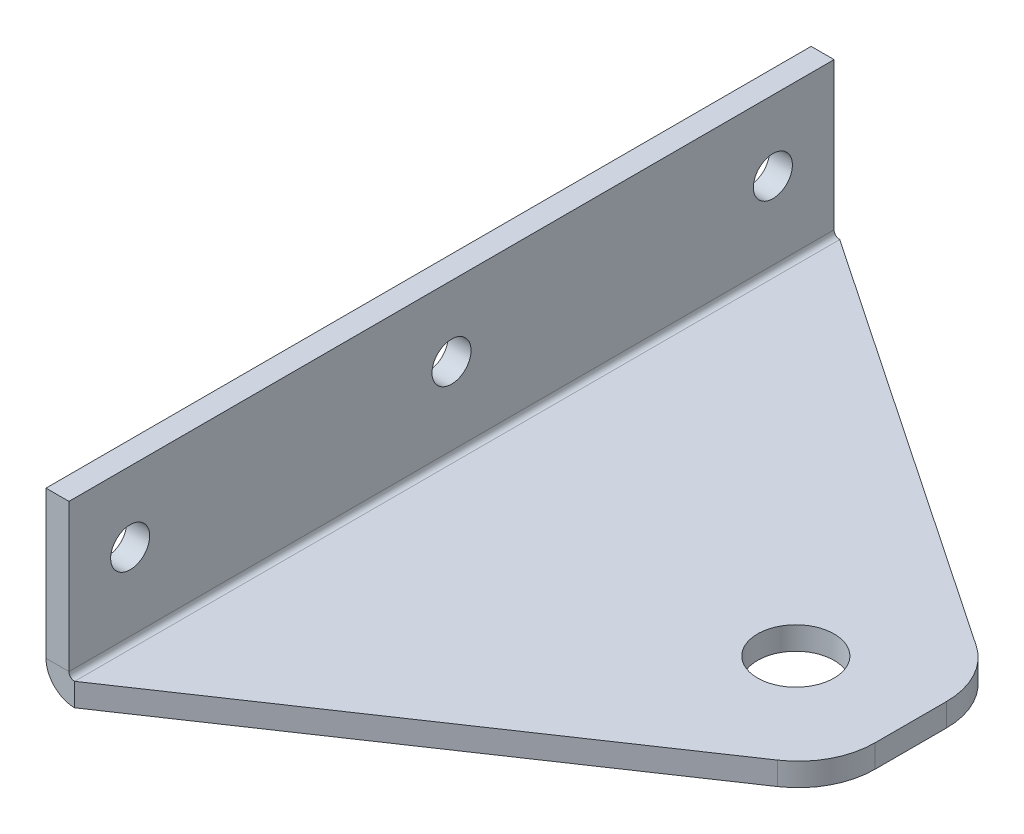
ISO-10303-21;
HEADER;
FILE_DESCRIPTION(('STEP AP214'),'2;1');
FILE_NAME('part.step','',(''),(''),'','','');
FILE_SCHEMA(('AUTOMOTIVE_DESIGN { 1 0 10303 214 1 1 1 1 }'));
ENDSEC;
DATA;
#1=APPLICATION_CONTEXT('core data for automotive mechanical design processes');
#2=APPLICATION_PROTOCOL_DEFINITION('international standard','automotive_design',2000,#1);
#3=PRODUCT_CONTEXT('',#1,'mechanical');
#4=PRODUCT('Part','Part','',(#3));
#5=PRODUCT_RELATED_PRODUCT_CATEGORY('part','',(#4));
#6=PRODUCT_DEFINITION_FORMATION('','',#4);
#7=PRODUCT_DEFINITION_CONTEXT('part definition',#1,'design');
#8=PRODUCT_DEFINITION('design','',#6,#7);
#9=PRODUCT_DEFINITION_SHAPE('','',#8);
#10=(LENGTH_UNIT() NAMED_UNIT(*) SI_UNIT(.MILLI.,.METRE.));
#11=(NAMED_UNIT(*) PLANE_ANGLE_UNIT() SI_UNIT($,.RADIAN.));
#12=(NAMED_UNIT(*) SI_UNIT($,.STERADIAN.) SOLID_ANGLE_UNIT());
#13=UNCERTAINTY_MEASURE_WITH_UNIT(LENGTH_MEASURE(1.E-05),#10,'distance_accuracy_value','');
#14=(GEOMETRIC_REPRESENTATION_CONTEXT(3) GLOBAL_UNCERTAINTY_ASSIGNED_CONTEXT((#13)) GLOBAL_UNIT_ASSIGNED_CONTEXT((#10,
#11,#12)) REPRESENTATION_CONTEXT('',''));
#15=CARTESIAN_POINT('',(0.,0.,0.));
#16=DIRECTION('',(0.,0.,1.));
#17=DIRECTION('',(1.,0.,0.));
#18=AXIS2_PLACEMENT_3D('',#15,#16,#17);
#19=CARTESIAN_POINT('',(0.,-3.,100.));
#20=DIRECTION('',(0.,1.,0.));
#21=DIRECTION('',(0.,0.,1.));
#22=AXIS2_PLACEMENT_3D('',#19,#20,#21);
#23=PLANE('',#22);
#24=CARTESIAN_POINT('',(45.,-3.,50.));
#25=DIRECTION('',(0.,1.,0.));
#26=DIRECTION('',(0.,0.,1.));
#27=AXIS2_PLACEMENT_3D('',#24,#25,#26);
#28=CIRCLE('',#27,5.);
#29=CARTESIAN_POINT('',(45.,-3.,55.));
#30=VERTEX_POINT('',#29);
#31=EDGE_CURVE('E203',#30,#30,#28,.F.);
#32=ORIENTED_EDGE('',*,*,#31,.F.);
#33=EDGE_LOOP('',(#32));
#34=FACE_BOUND('',#33,.T.);
#35=DIRECTION('',(-0.828866800988088,0.,0.559445999377753));
#36=VECTOR('',#35,1.);
#37=CARTESIAN_POINT('',(0.230540939993486,-3.,100.34156599858));
#38=LINE('',#37,#36);
#39=CARTESIAN_POINT('',(55.5944599937775,-3.,62.9735317286707));
#40=VERTEX_POINT('',#39);
#41=CARTESIAN_POINT('',(0.7366,-3.,100.));
#42=VERTEX_POINT('',#41);
#43=EDGE_CURVE('E223',#40,#42,#38,.T.);
#44=ORIENTED_EDGE('',*,*,#43,.T.);
#45=DIRECTION('',(0.,0.,-1.));
#46=VECTOR('',#45,1.);
#47=CARTESIAN_POINT('',(0.7366,-3.,100.));
#48=LINE('',#47,#46);
#49=CARTESIAN_POINT('',(0.7366,-3.,0.));
#50=VERTEX_POINT('',#49);
#51=EDGE_CURVE('E131',#42,#50,#48,.T.);
#52=ORIENTED_EDGE('',*,*,#51,.T.);
#53=DIRECTION('',(0.828866800988088,0.,0.559445999377753));
#54=VECTOR('',#53,1.);
#55=CARTESIAN_POINT('',(46.6011625229757,-3.,30.956416623397));
#56=LINE('',#55,#54);
#57=CARTESIAN_POINT('',(55.5944599937775,-3.,37.0264682713293));
#58=VERTEX_POINT('',#57);
#59=EDGE_CURVE('E84',#50,#58,#56,.T.);
#60=ORIENTED_EDGE('',*,*,#59,.T.);
#61=CARTESIAN_POINT('',(50.,-3.,45.3151362812103));
#62=DIRECTION('',(0.,1.,0.));
#63=DIRECTION('',(0.,0.,1.));
#64=AXIS2_PLACEMENT_3D('',#61,#62,#63);
#65=CIRCLE('',#64,9.99999999999999);
#66=CARTESIAN_POINT('',(60.,-3.,45.3151362812103));
#67=VERTEX_POINT('',#66);
#68=EDGE_CURVE('E179',#58,#67,#65,.F.);
#69=ORIENTED_EDGE('',*,*,#68,.T.);
#70=DIRECTION('',(0.,0.,-1.));
#71=VECTOR('',#70,1.);
#72=CARTESIAN_POINT('',(60.,-3.,100.));
#73=LINE('',#72,#71);
#74=CARTESIAN_POINT('',(60.,-3.,54.6848637187897));
#75=VERTEX_POINT('',#74);
#76=EDGE_CURVE('E157',#75,#67,#73,.T.);
#77=ORIENTED_EDGE('',*,*,#76,.F.);
#78=CARTESIAN_POINT('',(50.,-3.,54.6848637187897));
#79=DIRECTION('',(0.,1.,0.));
#80=DIRECTION('',(0.,0.,1.));
#81=AXIS2_PLACEMENT_3D('',#78,#79,#80);
#82=CIRCLE('',#81,10.);
#83=EDGE_CURVE('E227',#75,#40,#82,.F.);
#84=ORIENTED_EDGE('',*,*,#83,.T.);
#85=EDGE_LOOP('',(#44,#52,#60,#69,#77,#84));
#86=FACE_BOUND('',#85,.T.);
#87=ADVANCED_FACE('F39',(#34,#86),#23,.F.);
#88=CARTESIAN_POINT('',(0.,0.,100.));
#89=DIRECTION('',(0.,1.,0.));
#90=DIRECTION('',(0.,0.,1.));
#91=AXIS2_PLACEMENT_3D('',#88,#89,#90);
#92=PLANE('',#91);
#93=CARTESIAN_POINT('',(45.,0.,50.));
#94=DIRECTION('',(0.,1.,0.));
#95=DIRECTION('',(0.,0.,1.));
#96=AXIS2_PLACEMENT_3D('',#93,#94,#95);
#97=CIRCLE('',#96,5.);
#98=CARTESIAN_POINT('',(45.,0.,55.));
#99=VERTEX_POINT('',#98);
#100=EDGE_CURVE('E206',#99,#99,#97,.T.);
#101=ORIENTED_EDGE('',*,*,#100,.F.);
#102=EDGE_LOOP('',(#101));
#103=FACE_BOUND('',#102,.T.);
#104=DIRECTION('',(0.,0.,-1.));
#105=VECTOR('',#104,1.);
#106=CARTESIAN_POINT('',(0.7366,0.,100.));
#107=LINE('',#106,#105);
#108=CARTESIAN_POINT('',(0.7366,0.,100.));
#109=VERTEX_POINT('',#108);
#110=CARTESIAN_POINT('',(0.7366,0.,0.));
#111=VERTEX_POINT('',#110);
#112=EDGE_CURVE('E151',#109,#111,#107,.T.);
#113=ORIENTED_EDGE('',*,*,#112,.F.);
#114=DIRECTION('',(-0.828866800988088,0.,0.559445999377753));
#115=VECTOR('',#114,1.);
#116=CARTESIAN_POINT('',(0.230540939993486,0.,100.34156599858));
#117=LINE('',#116,#115);
#118=CARTESIAN_POINT('',(55.5944599937775,0.,62.9735317286707));
#119=VERTEX_POINT('',#118);
#120=EDGE_CURVE('E92',#119,#109,#117,.T.);
#121=ORIENTED_EDGE('',*,*,#120,.F.);
#122=CARTESIAN_POINT('',(50.,0.,54.6848637187897));
#123=DIRECTION('',(0.,1.,0.));
#124=DIRECTION('',(0.,0.,1.));
#125=AXIS2_PLACEMENT_3D('',#122,#123,#124);
#126=CIRCLE('',#125,10.);
#127=CARTESIAN_POINT('',(60.,0.,54.6848637187897));
#128=VERTEX_POINT('',#127);
#129=EDGE_CURVE('E226',#128,#119,#126,.F.);
#130=ORIENTED_EDGE('',*,*,#129,.F.);
#131=DIRECTION('',(0.,0.,-1.));
#132=VECTOR('',#131,1.);
#133=CARTESIAN_POINT('',(60.,0.,100.));
#134=LINE('',#133,#132);
#135=CARTESIAN_POINT('',(60.,0.,45.3151362812103));
#136=VERTEX_POINT('',#135);
#137=EDGE_CURVE('E154',#128,#136,#134,.T.);
#138=ORIENTED_EDGE('',*,*,#137,.T.);
#139=CARTESIAN_POINT('',(50.,0.,45.3151362812103));
#140=DIRECTION('',(0.,1.,0.));
#141=DIRECTION('',(0.,0.,1.));
#142=AXIS2_PLACEMENT_3D('',#139,#140,#141);
#143=CIRCLE('',#142,9.99999999999999);
#144=CARTESIAN_POINT('',(55.5944599937775,0.,37.0264682713294));
#145=VERTEX_POINT('',#144);
#146=EDGE_CURVE('E178',#145,#136,#143,.F.);
#147=ORIENTED_EDGE('',*,*,#146,.F.);
#148=DIRECTION('',(0.828866800988088,0.,0.559445999377753));
#149=VECTOR('',#148,1.);
#150=CARTESIAN_POINT('',(46.6011625229757,0.,30.956416623397));
#151=LINE('',#150,#149);
#152=EDGE_CURVE('E166',#111,#145,#151,.T.);
#153=ORIENTED_EDGE('',*,*,#152,.F.);
#154=EDGE_LOOP('',(#113,#121,#130,#138,#147,#153));
#155=FACE_BOUND('',#154,.T.);
#156=ADVANCED_FACE('F175',(#103,#155),#92,.T.);
#157=CARTESIAN_POINT('',(60.,0.,100.));
#158=DIRECTION('',(1.,0.,0.));
#159=DIRECTION('',(0.,0.,-1.));
#160=AXIS2_PLACEMENT_3D('',#157,#158,#159);
#161=PLANE('',#160);
#162=DIRECTION('',(0.,-1.,0.));
#163=VECTOR('',#162,1.);
#164=CARTESIAN_POINT('',(60.,-3.,54.6848637187897));
#165=LINE('',#164,#163);
#166=EDGE_CURVE('E219',#75,#128,#165,.F.);
#167=ORIENTED_EDGE('',*,*,#166,.F.);
#168=ORIENTED_EDGE('',*,*,#76,.T.);
#169=DIRECTION('',(0.,-1.,0.));
#170=VECTOR('',#169,1.);
#171=CARTESIAN_POINT('',(60.,-3.,45.3151362812103));
#172=LINE('',#171,#170);
#173=EDGE_CURVE('E209',#67,#136,#172,.F.);
#174=ORIENTED_EDGE('',*,*,#173,.T.);
#175=ORIENTED_EDGE('',*,*,#137,.F.);
#176=EDGE_LOOP('',(#167,#168,#174,#175));
#177=FACE_BOUND('',#176,.T.);
#178=ADVANCED_FACE('F273',(#177),#161,.T.);
#179=CARTESIAN_POINT('',(0.7366,0.,100.));
#180=DIRECTION('',(0.,0.,1.));
#181=DIRECTION('',(1.,0.,0.));
#182=AXIS2_PLACEMENT_3D('',#179,#180,#181);
#183=PLANE('',#182);
#184=DIRECTION('',(0.,-1.,0.));
#185=VECTOR('',#184,1.);
#186=CARTESIAN_POINT('',(0.7366,0.,100.));
#187=LINE('',#186,#185);
#188=EDGE_CURVE('E11',#109,#42,#187,.T.);
#189=ORIENTED_EDGE('',*,*,#188,.F.);
#190=CARTESIAN_POINT('',(0.7366,0.7366,100.));
#191=DIRECTION('',(0.,0.,-1.));
#192=DIRECTION('',(-1.,0.,0.));
#193=AXIS2_PLACEMENT_3D('',#190,#191,#192);
#194=CIRCLE('',#193,0.7366);
#195=CARTESIAN_POINT('',(0.,0.7366,100.));
#196=VERTEX_POINT('',#195);
#197=EDGE_CURVE('E120',#196,#109,#194,.F.);
#198=ORIENTED_EDGE('',*,*,#197,.F.);
#199=DIRECTION('',(1.,0.,0.));
#200=VECTOR('',#199,1.);
#201=CARTESIAN_POINT('',(-3.,0.736600000000001,100.));
#202=LINE('',#201,#200);
#203=CARTESIAN_POINT('',(-3.,0.736600000000001,100.));
#204=VERTEX_POINT('',#203);
#205=EDGE_CURVE('E48',#204,#196,#202,.T.);
#206=ORIENTED_EDGE('',*,*,#205,.F.);
#207=CARTESIAN_POINT('',(0.7366,0.7366,100.));
#208=DIRECTION('',(0.,0.,1.));
#209=DIRECTION('',(1.,0.,0.));
#210=AXIS2_PLACEMENT_3D('',#207,#208,#209);
#211=CIRCLE('',#210,3.7366);
#212=EDGE_CURVE('E126',#204,#42,#211,.T.);
#213=ORIENTED_EDGE('',*,*,#212,.T.);
#214=EDGE_LOOP('',(#189,#198,#206,#213));
#215=FACE_BOUND('',#214,.T.);
#216=ADVANCED_FACE('F41',(#215),#183,.T.);
#217=CARTESIAN_POINT('',(0.,0.7366,0.));
#218=DIRECTION('',(0.,0.,-1.));
#219=DIRECTION('',(-1.,0.,0.));
#220=AXIS2_PLACEMENT_3D('',#217,#218,#219);
#221=PLANE('',#220);
#222=DIRECTION('',(-1.,0.,0.));
#223=VECTOR('',#222,1.);
#224=CARTESIAN_POINT('',(0.,0.7366,0.));
#225=LINE('',#224,#223);
#226=CARTESIAN_POINT('',(0.,0.7366,0.));
#227=VERTEX_POINT('',#226);
#228=CARTESIAN_POINT('',(-3.,0.736600000000001,0.));
#229=VERTEX_POINT('',#228);
#230=EDGE_CURVE('E76',#227,#229,#225,.T.);
#231=ORIENTED_EDGE('',*,*,#230,.F.);
#232=CARTESIAN_POINT('',(0.7366,0.7366,0.));
#233=DIRECTION('',(0.,0.,-1.));
#234=DIRECTION('',(-1.,0.,0.));
#235=AXIS2_PLACEMENT_3D('',#232,#233,#234);
#236=CIRCLE('',#235,0.7366);
#237=EDGE_CURVE('E132',#227,#111,#236,.F.);
#238=ORIENTED_EDGE('',*,*,#237,.T.);
#239=DIRECTION('',(0.,1.,0.));
#240=VECTOR('',#239,1.);
#241=CARTESIAN_POINT('',(0.7366,-3.,0.));
#242=LINE('',#241,#240);
#243=EDGE_CURVE('E160',#50,#111,#242,.T.);
#244=ORIENTED_EDGE('',*,*,#243,.F.);
#245=CARTESIAN_POINT('',(0.7366,0.7366,0.));
#246=DIRECTION('',(0.,0.,1.));
#247=DIRECTION('',(1.,0.,0.));
#248=AXIS2_PLACEMENT_3D('',#245,#246,#247);
#249=CIRCLE('',#248,3.7366);
#250=EDGE_CURVE('E141',#229,#50,#249,.T.);
#251=ORIENTED_EDGE('',*,*,#250,.F.);
#252=EDGE_LOOP('',(#231,#238,#244,#251));
#253=FACE_BOUND('',#252,.T.);
#254=ADVANCED_FACE('F184',(#253),#221,.T.);
#255=CARTESIAN_POINT('',(0.7366,-3.,0.));
#256=DIRECTION('',(0.,0.,-1.));
#257=DIRECTION('',(-1.,0.,0.));
#258=AXIS2_PLACEMENT_3D('',#255,#256,#257);
#259=PLANE('',#258);
#260=DIRECTION('',(0.,-1.,0.));
#261=VECTOR('',#260,1.);
#262=CARTESIAN_POINT('',(0.,20.,0.));
#263=LINE('',#262,#261);
#264=CARTESIAN_POINT('',(0.,20.,0.));
#265=VERTEX_POINT('',#264);
#266=EDGE_CURVE('E107',#265,#227,#263,.T.);
#267=ORIENTED_EDGE('',*,*,#266,.T.);
#268=ORIENTED_EDGE('',*,*,#230,.T.);
#269=DIRECTION('',(0.,-1.,0.));
#270=VECTOR('',#269,1.);
#271=CARTESIAN_POINT('',(-3.,20.,0.));
#272=LINE('',#271,#270);
#273=CARTESIAN_POINT('',(-3.,20.,0.));
#274=VERTEX_POINT('',#273);
#275=EDGE_CURVE('E139',#274,#229,#272,.T.);
#276=ORIENTED_EDGE('',*,*,#275,.F.);
#277=DIRECTION('',(1.,0.,0.));
#278=VECTOR('',#277,1.);
#279=CARTESIAN_POINT('',(-3.,20.,0.));
#280=LINE('',#279,#278);
#281=EDGE_CURVE('E137',#274,#265,#280,.T.);
#282=ORIENTED_EDGE('',*,*,#281,.T.);
#283=EDGE_LOOP('',(#267,#268,#276,#282));
#284=FACE_BOUND('',#283,.T.);
#285=ADVANCED_FACE('F259',(#284),#259,.T.);
#286=CARTESIAN_POINT('',(0.7366,0.7366,100.));
#287=DIRECTION('',(0.,0.,-1.));
#288=DIRECTION('',(-1.,0.,0.));
#289=AXIS2_PLACEMENT_3D('',#286,#287,#288);
#290=CYLINDRICAL_SURFACE('',#289,0.7366);
#291=ORIENTED_EDGE('',*,*,#237,.F.);
#292=DIRECTION('',(0.,0.,-1.));
#293=VECTOR('',#292,1.);
#294=CARTESIAN_POINT('',(0.,0.7366,100.));
#295=LINE('',#294,#293);
#296=EDGE_CURVE('E112',#196,#227,#295,.T.);
#297=ORIENTED_EDGE('',*,*,#296,.F.);
#298=ORIENTED_EDGE('',*,*,#197,.T.);
#299=ORIENTED_EDGE('',*,*,#112,.T.);
#300=EDGE_LOOP('',(#291,#297,#298,#299));
#301=FACE_BOUND('',#300,.T.);
#302=ADVANCED_FACE('F183',(#301),#290,.F.);
#303=CARTESIAN_POINT('',(0.,20.,100.));
#304=DIRECTION('',(1.,0.,0.));
#305=DIRECTION('',(0.,1.,0.));
#306=AXIS2_PLACEMENT_3D('',#303,#304,#305);
#307=PLANE('',#306);
#308=CARTESIAN_POINT('',(0.,10.8130821861345,50.));
#309=DIRECTION('',(1.,0.,0.));
#310=DIRECTION('',(0.,1.,0.));
#311=AXIS2_PLACEMENT_3D('',#308,#309,#310);
#312=CIRCLE('',#311,2.55);
#313=CARTESIAN_POINT('',(0.,13.3630821861345,50.));
#314=VERTEX_POINT('',#313);
#315=EDGE_CURVE('E200',#314,#314,#312,.T.);
#316=ORIENTED_EDGE('',*,*,#315,.F.);
#317=EDGE_LOOP('',(#316));
#318=FACE_BOUND('',#317,.T.);
#319=CARTESIAN_POINT('',(0.,10.8130821861345,8.));
#320=DIRECTION('',(1.,0.,0.));
#321=DIRECTION('',(0.,1.,0.));
#322=AXIS2_PLACEMENT_3D('',#319,#320,#321);
#323=CIRCLE('',#322,2.55);
#324=CARTESIAN_POINT('',(0.,13.3630821861345,8.));
#325=VERTEX_POINT('',#324);
#326=EDGE_CURVE('E194',#325,#325,#323,.T.);
#327=ORIENTED_EDGE('',*,*,#326,.F.);
#328=EDGE_LOOP('',(#327));
#329=FACE_BOUND('',#328,.T.);
#330=CARTESIAN_POINT('',(0.,10.8130821861345,92.));
#331=DIRECTION('',(1.,0.,0.));
#332=DIRECTION('',(0.,1.,0.));
#333=AXIS2_PLACEMENT_3D('',#330,#331,#332);
#334=CIRCLE('',#333,2.54999999999999);
#335=CARTESIAN_POINT('',(0.,13.3630821861345,92.));
#336=VERTEX_POINT('',#335);
#337=EDGE_CURVE('E188',#336,#336,#334,.T.);
#338=ORIENTED_EDGE('',*,*,#337,.F.);
#339=EDGE_LOOP('',(#338));
#340=FACE_BOUND('',#339,.T.);
#341=ORIENTED_EDGE('',*,*,#266,.F.);
#342=DIRECTION('',(0.,0.,-1.));
#343=VECTOR('',#342,1.);
#344=CARTESIAN_POINT('',(0.,20.,100.));
#345=LINE('',#344,#343);
#346=CARTESIAN_POINT('',(0.,20.,100.));
#347=VERTEX_POINT('',#346);
#348=EDGE_CURVE('E102',#347,#265,#345,.T.);
#349=ORIENTED_EDGE('',*,*,#348,.F.);
#350=DIRECTION('',(0.,-1.,0.));
#351=VECTOR('',#350,1.);
#352=CARTESIAN_POINT('',(0.,20.,100.));
#353=LINE('',#352,#351);
#354=EDGE_CURVE('E106',#347,#196,#353,.T.);
#355=ORIENTED_EDGE('',*,*,#354,.T.);
#356=ORIENTED_EDGE('',*,*,#296,.T.);
#357=EDGE_LOOP('',(#341,#349,#355,#356));
#358=FACE_BOUND('',#357,.T.);
#359=ADVANCED_FACE('F104',(#318,#329,#340,#358),#307,.T.);
#360=CARTESIAN_POINT('',(-3.,20.,100.));
#361=DIRECTION('',(0.,1.,0.));
#362=DIRECTION('',(0.,0.,1.));
#363=AXIS2_PLACEMENT_3D('',#360,#361,#362);
#364=PLANE('',#363);
#365=ORIENTED_EDGE('',*,*,#281,.F.);
#366=DIRECTION('',(0.,0.,-1.));
#367=VECTOR('',#366,1.);
#368=CARTESIAN_POINT('',(-3.,20.,100.));
#369=LINE('',#368,#367);
#370=CARTESIAN_POINT('',(-3.,20.,100.));
#371=VERTEX_POINT('',#370);
#372=EDGE_CURVE('E113',#371,#274,#369,.T.);
#373=ORIENTED_EDGE('',*,*,#372,.F.);
#374=DIRECTION('',(1.,0.,0.));
#375=VECTOR('',#374,1.);
#376=CARTESIAN_POINT('',(-3.,20.,100.));
#377=LINE('',#376,#375);
#378=EDGE_CURVE('E118',#371,#347,#377,.T.);
#379=ORIENTED_EDGE('',*,*,#378,.T.);
#380=ORIENTED_EDGE('',*,*,#348,.T.);
#381=EDGE_LOOP('',(#365,#373,#379,#380));
#382=FACE_BOUND('',#381,.T.);
#383=ADVANCED_FACE('F122',(#382),#364,.T.);
#384=CARTESIAN_POINT('',(-3.,20.,100.));
#385=DIRECTION('',(1.,0.,0.));
#386=DIRECTION('',(0.,1.,0.));
#387=AXIS2_PLACEMENT_3D('',#384,#385,#386);
#388=PLANE('',#387);
#389=CARTESIAN_POINT('',(-3.,10.8130821861345,50.));
#390=DIRECTION('',(1.,0.,0.));
#391=DIRECTION('',(0.,1.,0.));
#392=AXIS2_PLACEMENT_3D('',#389,#390,#391);
#393=CIRCLE('',#392,2.55);
#394=CARTESIAN_POINT('',(-3.,13.3630821861345,50.));
#395=VERTEX_POINT('',#394);
#396=EDGE_CURVE('E197',#395,#395,#393,.F.);
#397=ORIENTED_EDGE('',*,*,#396,.F.);
#398=EDGE_LOOP('',(#397));
#399=FACE_BOUND('',#398,.T.);
#400=CARTESIAN_POINT('',(-3.,10.8130821861345,8.));
#401=DIRECTION('',(1.,0.,0.));
#402=DIRECTION('',(0.,1.,0.));
#403=AXIS2_PLACEMENT_3D('',#400,#401,#402);
#404=CIRCLE('',#403,2.55);
#405=CARTESIAN_POINT('',(-3.,13.3630821861345,8.));
#406=VERTEX_POINT('',#405);
#407=EDGE_CURVE('E191',#406,#406,#404,.F.);
#408=ORIENTED_EDGE('',*,*,#407,.F.);
#409=EDGE_LOOP('',(#408));
#410=FACE_BOUND('',#409,.T.);
#411=CARTESIAN_POINT('',(-3.,10.8130821861345,92.));
#412=DIRECTION('',(1.,0.,0.));
#413=DIRECTION('',(0.,1.,0.));
#414=AXIS2_PLACEMENT_3D('',#411,#412,#413);
#415=CIRCLE('',#414,2.54999999999999);
#416=CARTESIAN_POINT('',(-3.,13.3630821861345,92.));
#417=VERTEX_POINT('',#416);
#418=EDGE_CURVE('E135',#417,#417,#415,.F.);
#419=ORIENTED_EDGE('',*,*,#418,.F.);
#420=EDGE_LOOP('',(#419));
#421=FACE_BOUND('',#420,.T.);
#422=ORIENTED_EDGE('',*,*,#275,.T.);
#423=DIRECTION('',(0.,0.,-1.));
#424=VECTOR('',#423,1.);
#425=CARTESIAN_POINT('',(-3.,0.736600000000001,100.));
#426=LINE('',#425,#424);
#427=EDGE_CURVE('E146',#204,#229,#426,.T.);
#428=ORIENTED_EDGE('',*,*,#427,.F.);
#429=DIRECTION('',(0.,-1.,0.));
#430=VECTOR('',#429,1.);
#431=CARTESIAN_POINT('',(-3.,20.,100.));
#432=LINE('',#431,#430);
#433=EDGE_CURVE('E124',#371,#204,#432,.T.);
#434=ORIENTED_EDGE('',*,*,#433,.F.);
#435=ORIENTED_EDGE('',*,*,#372,.T.);
#436=EDGE_LOOP('',(#422,#428,#434,#435));
#437=FACE_BOUND('',#436,.T.);
#438=ADVANCED_FACE('F258',(#399,#410,#421,#437),#388,.F.);
#439=CARTESIAN_POINT('',(0.7366,0.7366,100.));
#440=DIRECTION('',(0.,0.,-1.));
#441=DIRECTION('',(-1.,0.,0.));
#442=AXIS2_PLACEMENT_3D('',#439,#440,#441);
#443=CYLINDRICAL_SURFACE('',#442,3.7366);
#444=ORIENTED_EDGE('',*,*,#250,.T.);
#445=ORIENTED_EDGE('',*,*,#51,.F.);
#446=ORIENTED_EDGE('',*,*,#212,.F.);
#447=ORIENTED_EDGE('',*,*,#427,.T.);
#448=EDGE_LOOP('',(#444,#445,#446,#447));
#449=FACE_BOUND('',#448,.T.);
#450=ADVANCED_FACE('F255',(#449),#443,.T.);
#451=CARTESIAN_POINT('',(0.7366,0.7366,100.));
#452=DIRECTION('',(0.,0.,-1.));
#453=DIRECTION('',(-1.,0.,0.));
#454=AXIS2_PLACEMENT_3D('',#451,#452,#453);
#455=PLANE('',#454);
#456=ORIENTED_EDGE('',*,*,#433,.T.);
#457=ORIENTED_EDGE('',*,*,#205,.T.);
#458=ORIENTED_EDGE('',*,*,#354,.F.);
#459=ORIENTED_EDGE('',*,*,#378,.F.);
#460=EDGE_LOOP('',(#456,#457,#458,#459));
#461=FACE_BOUND('',#460,.T.);
#462=ADVANCED_FACE('F117',(#461),#455,.F.);
#463=CARTESIAN_POINT('',(-3.001,10.8130821861345,92.));
#464=DIRECTION('',(1.,0.,0.));
#465=DIRECTION('',(0.,1.,0.));
#466=AXIS2_PLACEMENT_3D('',#463,#464,#465);
#467=CYLINDRICAL_SURFACE('',#466,2.54999999999999);
#468=ORIENTED_EDGE('',*,*,#337,.T.);
#469=EDGE_LOOP('',(#468));
#470=FACE_BOUND('',#469,.T.);
#471=ORIENTED_EDGE('',*,*,#418,.T.);
#472=EDGE_LOOP('',(#471));
#473=FACE_BOUND('',#472,.T.);
#474=ADVANCED_FACE('F293',(#470,#473),#467,.F.);
#475=CARTESIAN_POINT('',(-3.001,10.8130821861345,8.));
#476=DIRECTION('',(1.,0.,0.));
#477=DIRECTION('',(0.,1.,0.));
#478=AXIS2_PLACEMENT_3D('',#475,#476,#477);
#479=CYLINDRICAL_SURFACE('',#478,2.55);
#480=ORIENTED_EDGE('',*,*,#326,.T.);
#481=EDGE_LOOP('',(#480));
#482=FACE_BOUND('',#481,.T.);
#483=ORIENTED_EDGE('',*,*,#407,.T.);
#484=EDGE_LOOP('',(#483));
#485=FACE_BOUND('',#484,.T.);
#486=ADVANCED_FACE('F296',(#482,#485),#479,.F.);
#487=CARTESIAN_POINT('',(-3.001,10.8130821861345,50.));
#488=DIRECTION('',(1.,0.,0.));
#489=DIRECTION('',(0.,1.,0.));
#490=AXIS2_PLACEMENT_3D('',#487,#488,#489);
#491=CYLINDRICAL_SURFACE('',#490,2.55);
#492=ORIENTED_EDGE('',*,*,#315,.T.);
#493=EDGE_LOOP('',(#492));
#494=FACE_BOUND('',#493,.T.);
#495=ORIENTED_EDGE('',*,*,#396,.T.);
#496=EDGE_LOOP('',(#495));
#497=FACE_BOUND('',#496,.T.);
#498=ADVANCED_FACE('F300',(#494,#497),#491,.F.);
#499=CARTESIAN_POINT('',(45.,-3.001,50.));
#500=DIRECTION('',(0.,1.,0.));
#501=DIRECTION('',(0.,0.,1.));
#502=AXIS2_PLACEMENT_3D('',#499,#500,#501);
#503=CYLINDRICAL_SURFACE('',#502,5.);
#504=ORIENTED_EDGE('',*,*,#100,.T.);
#505=EDGE_LOOP('',(#504));
#506=FACE_BOUND('',#505,.T.);
#507=ORIENTED_EDGE('',*,*,#31,.T.);
#508=EDGE_LOOP('',(#507));
#509=FACE_BOUND('',#508,.T.);
#510=ADVANCED_FACE('F304',(#506,#509),#503,.F.);
#511=CARTESIAN_POINT('',(50.,-3.,45.3151362812103));
#512=DIRECTION('',(0.,1.,0.));
#513=DIRECTION('',(0.,0.,1.));
#514=AXIS2_PLACEMENT_3D('',#511,#512,#513);
#515=CYLINDRICAL_SURFACE('',#514,9.99999999999999);
#516=ORIENTED_EDGE('',*,*,#173,.F.);
#517=ORIENTED_EDGE('',*,*,#68,.F.);
#518=DIRECTION('',(0.,-1.,0.));
#519=VECTOR('',#518,1.);
#520=CARTESIAN_POINT('',(55.5944599937775,-3.,37.0264682713293));
#521=LINE('',#520,#519);
#522=EDGE_CURVE('E212',#58,#145,#521,.F.);
#523=ORIENTED_EDGE('',*,*,#522,.T.);
#524=ORIENTED_EDGE('',*,*,#146,.T.);
#525=EDGE_LOOP('',(#516,#517,#523,#524));
#526=FACE_BOUND('',#525,.T.);
#527=ADVANCED_FACE('F308',(#526),#515,.T.);
#528=CARTESIAN_POINT('',(46.6011625229757,-3.,30.956416623397));
#529=DIRECTION('',(-0.559445999377753,0.,0.828866800988088));
#530=DIRECTION('',(0.828866800988088,0.,0.559445999377753));
#531=AXIS2_PLACEMENT_3D('',#528,#529,#530);
#532=PLANE('',#531);
#533=ORIENTED_EDGE('',*,*,#522,.F.);
#534=ORIENTED_EDGE('',*,*,#59,.F.);
#535=ORIENTED_EDGE('',*,*,#243,.T.);
#536=ORIENTED_EDGE('',*,*,#152,.T.);
#537=EDGE_LOOP('',(#533,#534,#535,#536));
#538=FACE_BOUND('',#537,.T.);
#539=ADVANCED_FACE('F165',(#538),#532,.F.);
#540=CARTESIAN_POINT('',(0.230540939993486,-3.,100.34156599858));
#541=DIRECTION('',(-0.559445999377753,0.,-0.828866800988088));
#542=DIRECTION('',(-0.828866800988088,0.,0.559445999377753));
#543=AXIS2_PLACEMENT_3D('',#540,#541,#542);
#544=PLANE('',#543);
#545=ORIENTED_EDGE('',*,*,#188,.T.);
#546=ORIENTED_EDGE('',*,*,#43,.F.);
#547=DIRECTION('',(0.,-1.,0.));
#548=VECTOR('',#547,1.);
#549=CARTESIAN_POINT('',(55.5944599937775,-3.,62.9735317286707));
#550=LINE('',#549,#548);
#551=EDGE_CURVE('E217',#40,#119,#550,.F.);
#552=ORIENTED_EDGE('',*,*,#551,.T.);
#553=ORIENTED_EDGE('',*,*,#120,.T.);
#554=EDGE_LOOP('',(#545,#546,#552,#553));
#555=FACE_BOUND('',#554,.T.);
#556=ADVANCED_FACE('F245',(#555),#544,.F.);
#557=CARTESIAN_POINT('',(50.,-3.,54.6848637187897));
#558=DIRECTION('',(0.,1.,0.));
#559=DIRECTION('',(0.,0.,1.));
#560=AXIS2_PLACEMENT_3D('',#557,#558,#559);
#561=CYLINDRICAL_SURFACE('',#560,10.);
#562=ORIENTED_EDGE('',*,*,#551,.F.);
#563=ORIENTED_EDGE('',*,*,#83,.F.);
#564=ORIENTED_EDGE('',*,*,#166,.T.);
#565=ORIENTED_EDGE('',*,*,#129,.T.);
#566=EDGE_LOOP('',(#562,#563,#564,#565));
#567=FACE_BOUND('',#566,.T.);
#568=ADVANCED_FACE('F236',(#567),#561,.T.);
#569=CLOSED_SHELL('',(#87,#156,#178,#216,#254,#285,#302,#359,#383,#438,#450,#462,#474,#486,#498,
#510,#527,#539,#556,#568));
#570=MANIFOLD_SOLID_BREP('B2',#569);
#571=ADVANCED_BREP_SHAPE_REPRESENTATION('',(#18,#570),#14);
#572=SHAPE_DEFINITION_REPRESENTATION(#9,#571);
ENDSEC;
END-ISO-10303-21;
